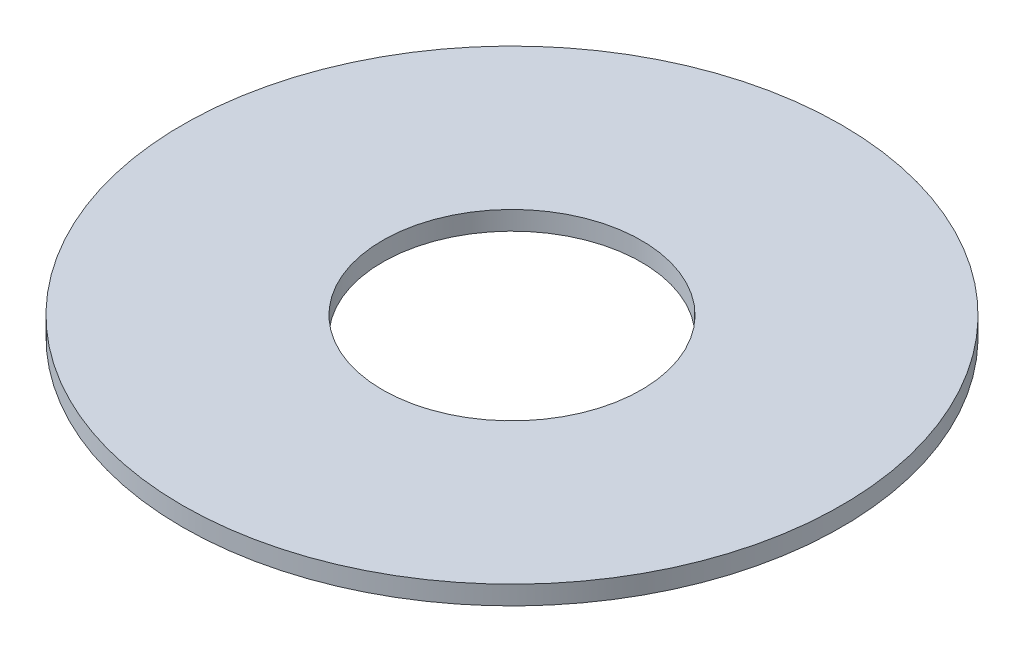
ISO-10303-21;
HEADER;
FILE_DESCRIPTION(('STEP AP214'),'2;1');
FILE_NAME('part.step','',(''),(''),'','','');
FILE_SCHEMA(('AUTOMOTIVE_DESIGN { 1 0 10303 214 1 1 1 1 }'));
ENDSEC;
DATA;
#1=APPLICATION_CONTEXT('core data for automotive mechanical design processes');
#2=APPLICATION_PROTOCOL_DEFINITION('international standard','automotive_design',2000,#1);
#3=PRODUCT_CONTEXT('',#1,'mechanical');
#4=PRODUCT('Part','Part','',(#3));
#5=PRODUCT_RELATED_PRODUCT_CATEGORY('part','',(#4));
#6=PRODUCT_DEFINITION_FORMATION('','',#4);
#7=PRODUCT_DEFINITION_CONTEXT('part definition',#1,'design');
#8=PRODUCT_DEFINITION('design','',#6,#7);
#9=PRODUCT_DEFINITION_SHAPE('','',#8);
#10=(LENGTH_UNIT() NAMED_UNIT(*) SI_UNIT(.MILLI.,.METRE.));
#11=(NAMED_UNIT(*) PLANE_ANGLE_UNIT() SI_UNIT($,.RADIAN.));
#12=(NAMED_UNIT(*) SI_UNIT($,.STERADIAN.) SOLID_ANGLE_UNIT());
#13=UNCERTAINTY_MEASURE_WITH_UNIT(LENGTH_MEASURE(1.E-05),#10,'distance_accuracy_value','');
#14=(GEOMETRIC_REPRESENTATION_CONTEXT(3) GLOBAL_UNCERTAINTY_ASSIGNED_CONTEXT((#13)) GLOBAL_UNIT_ASSIGNED_CONTEXT((#10,
#11,#12)) REPRESENTATION_CONTEXT('',''));
#15=CARTESIAN_POINT('',(0.,0.,0.));
#16=DIRECTION('',(0.,0.,1.));
#17=DIRECTION('',(1.,0.,0.));
#18=AXIS2_PLACEMENT_3D('',#15,#16,#17);
#19=CARTESIAN_POINT('',(0.,4.,0.));
#20=DIRECTION('',(0.,-1.,0.));
#21=DIRECTION('',(0.,0.,-1.));
#22=AXIS2_PLACEMENT_3D('',#19,#20,#21);
#23=CYLINDRICAL_SURFACE('',#22,70.);
#24=CARTESIAN_POINT('',(0.,4.,0.));
#25=DIRECTION('',(0.,1.,0.));
#26=DIRECTION('',(0.,0.,1.));
#27=AXIS2_PLACEMENT_3D('',#24,#25,#26);
#28=CIRCLE('',#27,70.);
#29=CARTESIAN_POINT('',(0.,4.,70.));
#30=VERTEX_POINT('',#29);
#31=EDGE_CURVE('E10',#30,#30,#28,.T.);
#32=ORIENTED_EDGE('',*,*,#31,.F.);
#33=EDGE_LOOP('',(#32));
#34=FACE_BOUND('',#33,.T.);
#35=CARTESIAN_POINT('',(0.,0.,0.));
#36=DIRECTION('',(0.,1.,0.));
#37=DIRECTION('',(0.,0.,1.));
#38=AXIS2_PLACEMENT_3D('',#35,#36,#37);
#39=CIRCLE('',#38,70.);
#40=CARTESIAN_POINT('',(0.,0.,70.));
#41=VERTEX_POINT('',#40);
#42=EDGE_CURVE('E37',#41,#41,#39,.T.);
#43=ORIENTED_EDGE('',*,*,#42,.T.);
#44=EDGE_LOOP('',(#43));
#45=FACE_BOUND('',#44,.T.);
#46=ADVANCED_FACE('F40',(#34,#45),#23,.T.);
#47=CARTESIAN_POINT('',(0.,4.,0.));
#48=DIRECTION('',(0.,1.,0.));
#49=DIRECTION('',(0.,0.,1.));
#50=AXIS2_PLACEMENT_3D('',#47,#48,#49);
#51=PLANE('',#50);
#52=CARTESIAN_POINT('',(0.,4.,0.));
#53=DIRECTION('',(0.,1.,0.));
#54=DIRECTION('',(0.,0.,1.));
#55=AXIS2_PLACEMENT_3D('',#52,#53,#54);
#56=CIRCLE('',#55,27.5);
#57=CARTESIAN_POINT('',(0.,4.,27.5));
#58=VERTEX_POINT('',#57);
#59=EDGE_CURVE('E50',#58,#58,#56,.T.);
#60=ORIENTED_EDGE('',*,*,#59,.F.);
#61=EDGE_LOOP('',(#60));
#62=FACE_BOUND('',#61,.T.);
#63=ORIENTED_EDGE('',*,*,#31,.T.);
#64=EDGE_LOOP('',(#63));
#65=FACE_BOUND('',#64,.T.);
#66=ADVANCED_FACE('F59',(#62,#65),#51,.T.);
#67=CARTESIAN_POINT('',(0.,0.,0.));
#68=DIRECTION('',(0.,1.,0.));
#69=DIRECTION('',(0.,0.,1.));
#70=AXIS2_PLACEMENT_3D('',#67,#68,#69);
#71=PLANE('',#70);
#72=CARTESIAN_POINT('',(0.,0.,0.));
#73=DIRECTION('',(0.,1.,0.));
#74=DIRECTION('',(0.,0.,1.));
#75=AXIS2_PLACEMENT_3D('',#72,#73,#74);
#76=CIRCLE('',#75,27.5);
#77=CARTESIAN_POINT('',(0.,0.,27.5));
#78=VERTEX_POINT('',#77);
#79=EDGE_CURVE('E47',#78,#78,#76,.T.);
#80=ORIENTED_EDGE('',*,*,#79,.T.);
#81=EDGE_LOOP('',(#80));
#82=FACE_BOUND('',#81,.T.);
#83=ORIENTED_EDGE('',*,*,#42,.F.);
#84=EDGE_LOOP('',(#83));
#85=FACE_BOUND('',#84,.T.);
#86=ADVANCED_FACE('F58',(#82,#85),#71,.F.);
#87=CARTESIAN_POINT('',(0.,4.,0.));
#88=DIRECTION('',(0.,-1.,0.));
#89=DIRECTION('',(0.,0.,-1.));
#90=AXIS2_PLACEMENT_3D('',#87,#88,#89);
#91=CYLINDRICAL_SURFACE('',#90,27.5);
#92=ORIENTED_EDGE('',*,*,#59,.T.);
#93=EDGE_LOOP('',(#92));
#94=FACE_BOUND('',#93,.T.);
#95=ORIENTED_EDGE('',*,*,#79,.F.);
#96=EDGE_LOOP('',(#95));
#97=FACE_BOUND('',#96,.T.);
#98=ADVANCED_FACE('F54',(#94,#97),#91,.F.);
#99=CLOSED_SHELL('',(#46,#66,#86,#98));
#100=MANIFOLD_SOLID_BREP('B2',#99);
#101=ADVANCED_BREP_SHAPE_REPRESENTATION('',(#18,#100),#14);
#102=SHAPE_DEFINITION_REPRESENTATION(#9,#101);
ENDSEC;
END-ISO-10303-21;
